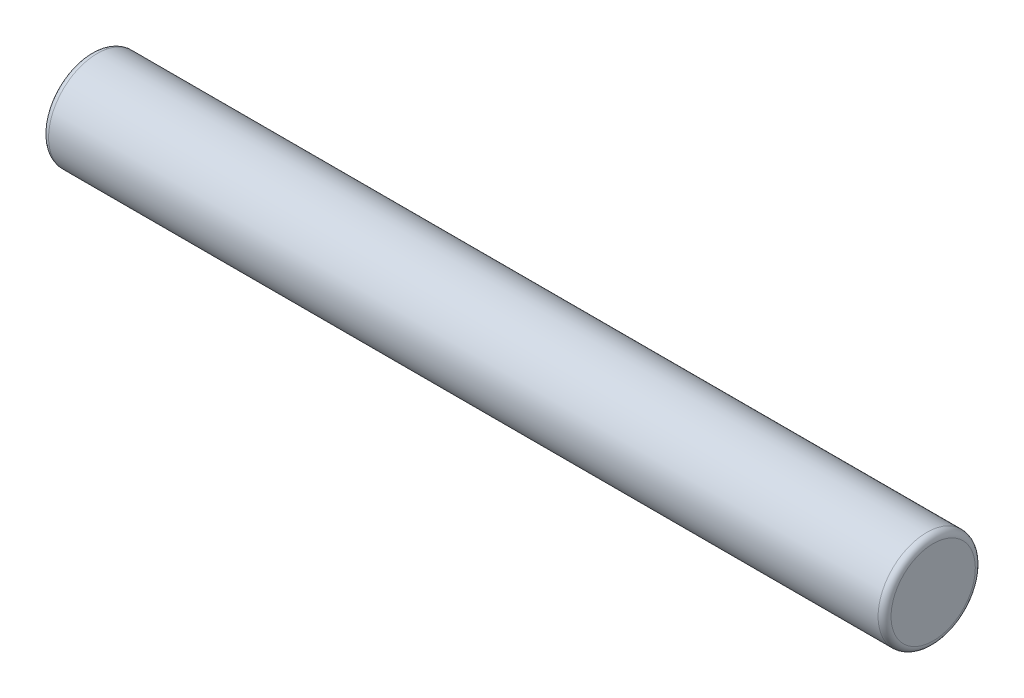
ISO-10303-21;
HEADER;
FILE_DESCRIPTION(('STEP AP214'),'2;1');
FILE_NAME('part.step','',(''),(''),'','','');
FILE_SCHEMA(('AUTOMOTIVE_DESIGN { 1 0 10303 214 1 1 1 1 }'));
ENDSEC;
DATA;
#1=APPLICATION_CONTEXT('core data for automotive mechanical design processes');
#2=APPLICATION_PROTOCOL_DEFINITION('international standard','automotive_design',2000,#1);
#3=PRODUCT_CONTEXT('',#1,'mechanical');
#4=PRODUCT('Part','Part','',(#3));
#5=PRODUCT_RELATED_PRODUCT_CATEGORY('part','',(#4));
#6=PRODUCT_DEFINITION_FORMATION('','',#4);
#7=PRODUCT_DEFINITION_CONTEXT('part definition',#1,'design');
#8=PRODUCT_DEFINITION('design','',#6,#7);
#9=PRODUCT_DEFINITION_SHAPE('','',#8);
#10=(LENGTH_UNIT() NAMED_UNIT(*) SI_UNIT(.MILLI.,.METRE.));
#11=(NAMED_UNIT(*) PLANE_ANGLE_UNIT() SI_UNIT($,.RADIAN.));
#12=(NAMED_UNIT(*) SI_UNIT($,.STERADIAN.) SOLID_ANGLE_UNIT());
#13=UNCERTAINTY_MEASURE_WITH_UNIT(LENGTH_MEASURE(1.E-05),#10,'distance_accuracy_value','');
#14=(GEOMETRIC_REPRESENTATION_CONTEXT(3) GLOBAL_UNCERTAINTY_ASSIGNED_CONTEXT((#13)) GLOBAL_UNIT_ASSIGNED_CONTEXT((#10,
#11,#12)) REPRESENTATION_CONTEXT('',''));
#15=CARTESIAN_POINT('',(0.,0.,0.));
#16=DIRECTION('',(0.,0.,1.));
#17=DIRECTION('',(1.,0.,0.));
#18=AXIS2_PLACEMENT_3D('',#15,#16,#17);
#19=CARTESIAN_POINT('',(13.,0.,0.));
#20=DIRECTION('',(-1.,0.,0.));
#21=DIRECTION('',(0.,0.,1.));
#22=AXIS2_PLACEMENT_3D('',#19,#20,#21);
#23=CYLINDRICAL_SURFACE('',#22,1.5);
#24=CARTESIAN_POINT('',(-12.8,0.,0.));
#25=DIRECTION('',(1.,0.,0.));
#26=DIRECTION('',(0.,0.,-1.));
#27=AXIS2_PLACEMENT_3D('',#24,#25,#26);
#28=CIRCLE('',#27,1.5);
#29=CARTESIAN_POINT('',(-12.8,0.,-1.5));
#30=VERTEX_POINT('',#29);
#31=EDGE_CURVE('E50',#30,#30,#28,.T.);
#32=ORIENTED_EDGE('',*,*,#31,.T.);
#33=EDGE_LOOP('',(#32));
#34=FACE_BOUND('',#33,.T.);
#35=CARTESIAN_POINT('',(12.8,0.,0.));
#36=DIRECTION('',(1.,0.,0.));
#37=DIRECTION('',(0.,0.,-1.));
#38=AXIS2_PLACEMENT_3D('',#35,#36,#37);
#39=CIRCLE('',#38,1.5);
#40=CARTESIAN_POINT('',(12.8,0.,-1.5));
#41=VERTEX_POINT('',#40);
#42=EDGE_CURVE('E55',#41,#41,#39,.F.);
#43=ORIENTED_EDGE('',*,*,#42,.T.);
#44=EDGE_LOOP('',(#43));
#45=FACE_BOUND('',#44,.T.);
#46=ADVANCED_FACE('F37',(#34,#45),#23,.T.);
#47=CARTESIAN_POINT('',(13.,0.,0.));
#48=DIRECTION('',(1.,0.,0.));
#49=DIRECTION('',(0.,0.,-1.));
#50=AXIS2_PLACEMENT_3D('',#47,#48,#49);
#51=PLANE('',#50);
#52=CARTESIAN_POINT('',(13.,0.,0.));
#53=DIRECTION('',(1.,0.,0.));
#54=DIRECTION('',(0.,0.,-1.));
#55=AXIS2_PLACEMENT_3D('',#52,#53,#54);
#56=CIRCLE('',#55,1.3);
#57=CARTESIAN_POINT('',(13.,0.,-1.3));
#58=VERTEX_POINT('',#57);
#59=EDGE_CURVE('E10',#58,#58,#56,.T.);
#60=ORIENTED_EDGE('',*,*,#59,.T.);
#61=EDGE_LOOP('',(#60));
#62=FACE_BOUND('',#61,.T.);
#63=ADVANCED_FACE('F72',(#62),#51,.T.);
#64=CARTESIAN_POINT('',(-13.,0.,0.));
#65=DIRECTION('',(1.,0.,0.));
#66=DIRECTION('',(0.,0.,-1.));
#67=AXIS2_PLACEMENT_3D('',#64,#65,#66);
#68=PLANE('',#67);
#69=CARTESIAN_POINT('',(-13.,0.,0.));
#70=DIRECTION('',(1.,0.,0.));
#71=DIRECTION('',(0.,0.,-1.));
#72=AXIS2_PLACEMENT_3D('',#69,#70,#71);
#73=CIRCLE('',#72,1.3);
#74=CARTESIAN_POINT('',(-13.,0.,-1.3));
#75=VERTEX_POINT('',#74);
#76=EDGE_CURVE('E45',#75,#75,#73,.F.);
#77=ORIENTED_EDGE('',*,*,#76,.T.);
#78=EDGE_LOOP('',(#77));
#79=FACE_BOUND('',#78,.T.);
#80=ADVANCED_FACE('F69',(#79),#68,.F.);
#81=CARTESIAN_POINT('',(-12.8,0.,0.));
#82=DIRECTION('',(1.,0.,0.));
#83=DIRECTION('',(0.,0.,-1.));
#84=AXIS2_PLACEMENT_3D('',#81,#82,#83);
#85=TOROIDAL_SURFACE('',#84,1.3,0.2);
#86=ORIENTED_EDGE('',*,*,#76,.F.);
#87=EDGE_LOOP('',(#86));
#88=FACE_BOUND('',#87,.T.);
#89=ORIENTED_EDGE('',*,*,#31,.F.);
#90=EDGE_LOOP('',(#89));
#91=FACE_BOUND('',#90,.T.);
#92=ADVANCED_FACE('F65',(#88,#91),#85,.T.);
#93=CARTESIAN_POINT('',(12.8,0.,0.));
#94=DIRECTION('',(1.,0.,0.));
#95=DIRECTION('',(0.,0.,-1.));
#96=AXIS2_PLACEMENT_3D('',#93,#94,#95);
#97=TOROIDAL_SURFACE('',#96,1.3,0.2);
#98=ORIENTED_EDGE('',*,*,#42,.F.);
#99=EDGE_LOOP('',(#98));
#100=FACE_BOUND('',#99,.T.);
#101=ORIENTED_EDGE('',*,*,#59,.F.);
#102=EDGE_LOOP('',(#101));
#103=FACE_BOUND('',#102,.T.);
#104=ADVANCED_FACE('F39',(#100,#103),#97,.T.);
#105=CLOSED_SHELL('',(#46,#63,#80,#92,#104));
#106=MANIFOLD_SOLID_BREP('B2',#105);
#107=ADVANCED_BREP_SHAPE_REPRESENTATION('',(#18,#106),#14);
#108=SHAPE_DEFINITION_REPRESENTATION(#9,#107);
ENDSEC;
END-ISO-10303-21;
